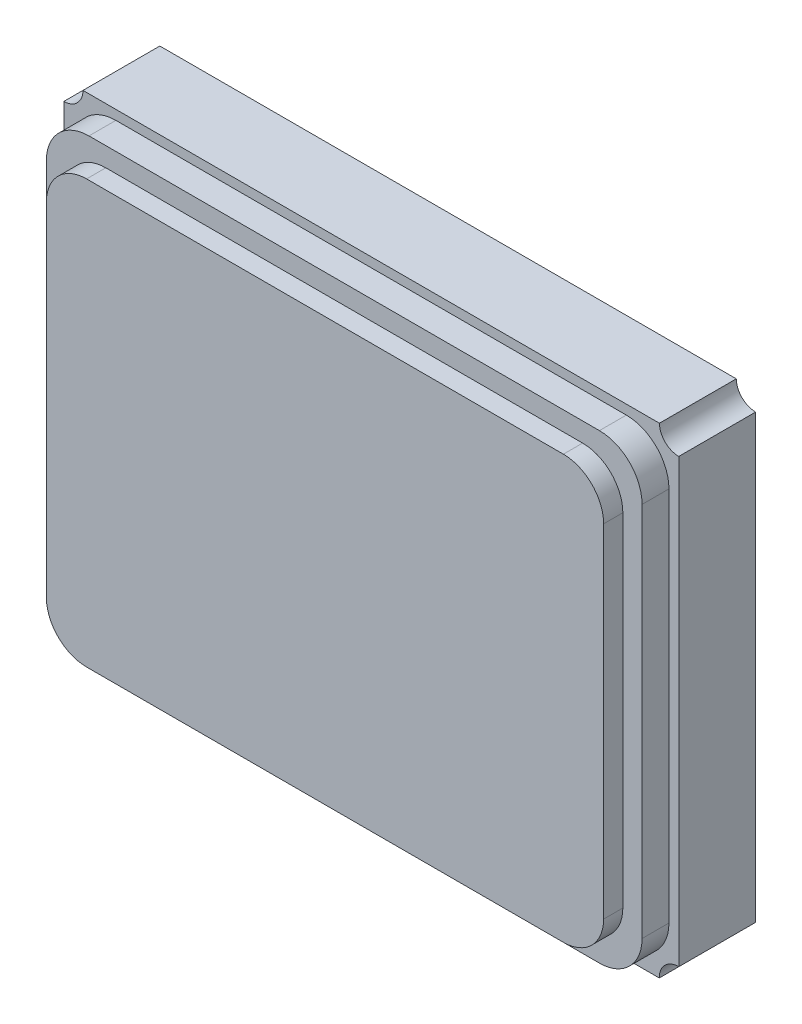
ISO-10303-21;
HEADER;
FILE_DESCRIPTION(('STEP AP214'),'2;1');
FILE_NAME('part.step','',(''),(''),'','','');
FILE_SCHEMA(('AUTOMOTIVE_DESIGN { 1 0 10303 214 1 1 1 1 }'));
ENDSEC;
DATA;
#1=APPLICATION_CONTEXT('core data for automotive mechanical design processes');
#2=APPLICATION_PROTOCOL_DEFINITION('international standard','automotive_design',2000,#1);
#3=PRODUCT_CONTEXT('',#1,'mechanical');
#4=PRODUCT('Part','Part','',(#3));
#5=PRODUCT_RELATED_PRODUCT_CATEGORY('part','',(#4));
#6=PRODUCT_DEFINITION_FORMATION('','',#4);
#7=PRODUCT_DEFINITION_CONTEXT('part definition',#1,'design');
#8=PRODUCT_DEFINITION('design','',#6,#7);
#9=PRODUCT_DEFINITION_SHAPE('','',#8);
#10=(LENGTH_UNIT() NAMED_UNIT(*) SI_UNIT(.MILLI.,.METRE.));
#11=(NAMED_UNIT(*) PLANE_ANGLE_UNIT() SI_UNIT($,.RADIAN.));
#12=(NAMED_UNIT(*) SI_UNIT($,.STERADIAN.) SOLID_ANGLE_UNIT());
#13=UNCERTAINTY_MEASURE_WITH_UNIT(LENGTH_MEASURE(1.E-05),#10,'distance_accuracy_value','');
#14=(GEOMETRIC_REPRESENTATION_CONTEXT(3) GLOBAL_UNCERTAINTY_ASSIGNED_CONTEXT((#13)) GLOBAL_UNIT_ASSIGNED_CONTEXT((#10,
#11,#12)) REPRESENTATION_CONTEXT('',''));
#15=CARTESIAN_POINT('',(0.,0.,0.));
#16=DIRECTION('',(0.,0.,1.));
#17=DIRECTION('',(1.,0.,0.));
#18=AXIS2_PLACEMENT_3D('',#15,#16,#17);
#19=CARTESIAN_POINT('',(0.,0.,0.64));
#20=DIRECTION('',(0.,0.,1.));
#21=DIRECTION('',(0.,-1.,0.));
#22=AXIS2_PLACEMENT_3D('',#19,#20,#21);
#23=PLANE('',#22);
#24=DIRECTION('',(0.,1.,0.));
#25=VECTOR('',#24,1.);
#26=CARTESIAN_POINT('',(-1.45,0.890692780974,0.64));
#27=LINE('',#26,#25);
#28=CARTESIAN_POINT('',(-1.45,0.890692780974,0.64));
#29=VERTEX_POINT('',#28);
#30=CARTESIAN_POINT('',(-1.45,-0.890692780974,0.64));
#31=VERTEX_POINT('',#30);
#32=EDGE_CURVE('E219',#29,#31,#27,.F.);
#33=ORIENTED_EDGE('',*,*,#32,.T.);
#34=CARTESIAN_POINT('',(-1.240692780974,-0.890692780974,0.64));
#35=DIRECTION('',(0.,0.,-1.));
#36=DIRECTION('',(-1.,0.,0.));
#37=AXIS2_PLACEMENT_3D('',#34,#35,#36);
#38=CIRCLE('',#37,0.209307219026);
#39=CARTESIAN_POINT('',(-1.240692780974,-1.1,0.64));
#40=VERTEX_POINT('',#39);
#41=EDGE_CURVE('E223',#40,#31,#38,.T.);
#42=ORIENTED_EDGE('',*,*,#41,.F.);
#43=DIRECTION('',(1.,0.,0.));
#44=VECTOR('',#43,1.);
#45=CARTESIAN_POINT('',(-1.240692780974,-1.1,0.64));
#46=LINE('',#45,#44);
#47=CARTESIAN_POINT('',(1.240692780974,-1.1,0.64));
#48=VERTEX_POINT('',#47);
#49=EDGE_CURVE('E182',#40,#48,#46,.T.);
#50=ORIENTED_EDGE('',*,*,#49,.T.);
#51=CARTESIAN_POINT('',(1.240692780974,-0.890692780974,0.64));
#52=DIRECTION('',(0.,0.,-1.));
#53=DIRECTION('',(-1.,0.,0.));
#54=AXIS2_PLACEMENT_3D('',#51,#52,#53);
#55=CIRCLE('',#54,0.209307219026);
#56=CARTESIAN_POINT('',(1.45,-0.890692780974,0.64));
#57=VERTEX_POINT('',#56);
#58=EDGE_CURVE('E20',#48,#57,#55,.F.);
#59=ORIENTED_EDGE('',*,*,#58,.T.);
#60=DIRECTION('',(0.,1.,0.));
#61=VECTOR('',#60,1.);
#62=CARTESIAN_POINT('',(1.45,-0.890692780974,0.64));
#63=LINE('',#62,#61);
#64=CARTESIAN_POINT('',(1.45,0.890692780974,0.64));
#65=VERTEX_POINT('',#64);
#66=EDGE_CURVE('E180',#57,#65,#63,.T.);
#67=ORIENTED_EDGE('',*,*,#66,.T.);
#68=CARTESIAN_POINT('',(1.240692780974,0.890692780974,0.64));
#69=DIRECTION('',(0.,0.,-1.));
#70=DIRECTION('',(-1.,0.,0.));
#71=AXIS2_PLACEMENT_3D('',#68,#69,#70);
#72=CIRCLE('',#71,0.209307219026);
#73=CARTESIAN_POINT('',(1.240692780974,1.1,0.64));
#74=VERTEX_POINT('',#73);
#75=EDGE_CURVE('E193',#74,#65,#72,.T.);
#76=ORIENTED_EDGE('',*,*,#75,.F.);
#77=DIRECTION('',(1.,0.,0.));
#78=VECTOR('',#77,1.);
#79=CARTESIAN_POINT('',(1.240692780974,1.1,0.64));
#80=LINE('',#79,#78);
#81=CARTESIAN_POINT('',(-1.240692780974,1.1,0.64));
#82=VERTEX_POINT('',#81);
#83=EDGE_CURVE('E211',#74,#82,#80,.F.);
#84=ORIENTED_EDGE('',*,*,#83,.T.);
#85=CARTESIAN_POINT('',(-1.240692780974,0.890692780974,0.64));
#86=DIRECTION('',(0.,0.,-1.));
#87=DIRECTION('',(-1.,0.,0.));
#88=AXIS2_PLACEMENT_3D('',#85,#86,#87);
#89=CIRCLE('',#88,0.209307219026);
#90=EDGE_CURVE('E215',#29,#82,#89,.T.);
#91=ORIENTED_EDGE('',*,*,#90,.F.);
#92=EDGE_LOOP('',(#33,#42,#50,#59,#67,#76,#84,#91));
#93=FACE_BOUND('',#92,.T.);
#94=ADVANCED_FACE('F17',(#93),#23,.T.);
#95=CARTESIAN_POINT('',(-1.240692780974,-1.1,0.54));
#96=DIRECTION('',(0.,1.,0.));
#97=DIRECTION('',(0.,0.,1.));
#98=AXIS2_PLACEMENT_3D('',#95,#96,#97);
#99=PLANE('',#98);
#100=DIRECTION('',(1.,0.,0.));
#101=VECTOR('',#100,1.);
#102=CARTESIAN_POINT('',(0.,-1.1,0.54));
#103=LINE('',#102,#101);
#104=CARTESIAN_POINT('',(1.240692780974,-1.1,0.54));
#105=VERTEX_POINT('',#104);
#106=CARTESIAN_POINT('',(-1.240692780974,-1.1,0.54));
#107=VERTEX_POINT('',#106);
#108=EDGE_CURVE('E200',#105,#107,#103,.F.);
#109=ORIENTED_EDGE('',*,*,#108,.F.);
#110=DIRECTION('',(0.,0.,-1.));
#111=VECTOR('',#110,1.);
#112=CARTESIAN_POINT('',(1.240692780974,-1.1,0.54));
#113=LINE('',#112,#111);
#114=EDGE_CURVE('E198',#48,#105,#113,.T.);
#115=ORIENTED_EDGE('',*,*,#114,.F.);
#116=ORIENTED_EDGE('',*,*,#49,.F.);
#117=DIRECTION('',(0.,0.,-1.));
#118=VECTOR('',#117,1.);
#119=CARTESIAN_POINT('',(-1.240692780974,-1.1,0.54));
#120=LINE('',#119,#118);
#121=EDGE_CURVE('E220',#107,#40,#120,.F.);
#122=ORIENTED_EDGE('',*,*,#121,.F.);
#123=EDGE_LOOP('',(#109,#115,#116,#122));
#124=FACE_BOUND('',#123,.T.);
#125=ADVANCED_FACE('F655',(#124),#99,.F.);
#126=CARTESIAN_POINT('',(-1.240692780974,-0.890692780974,0.54));
#127=DIRECTION('',(0.,0.,-1.));
#128=DIRECTION('',(-1.,0.,0.));
#129=AXIS2_PLACEMENT_3D('',#126,#127,#128);
#130=CYLINDRICAL_SURFACE('',#129,0.209307219026);
#131=ORIENTED_EDGE('',*,*,#41,.T.);
#132=DIRECTION('',(0.,0.,-1.));
#133=VECTOR('',#132,1.);
#134=CARTESIAN_POINT('',(-1.45,-0.890692780974,0.54));
#135=LINE('',#134,#133);
#136=CARTESIAN_POINT('',(-1.45,-0.890692780974,0.54));
#137=VERTEX_POINT('',#136);
#138=EDGE_CURVE('E216',#31,#137,#135,.T.);
#139=ORIENTED_EDGE('',*,*,#138,.T.);
#140=CARTESIAN_POINT('',(-1.240692780974,-0.890692780974,0.54));
#141=DIRECTION('',(0.,0.,-1.));
#142=DIRECTION('',(-1.,0.,0.));
#143=AXIS2_PLACEMENT_3D('',#140,#141,#142);
#144=CIRCLE('',#143,0.209307219026);
#145=EDGE_CURVE('E297',#107,#137,#144,.T.);
#146=ORIENTED_EDGE('',*,*,#145,.F.);
#147=ORIENTED_EDGE('',*,*,#121,.T.);
#148=EDGE_LOOP('',(#131,#139,#146,#147));
#149=FACE_BOUND('',#148,.T.);
#150=ADVANCED_FACE('F302',(#149),#130,.T.);
#151=CARTESIAN_POINT('',(-1.45,0.890692780974,0.54));
#152=DIRECTION('',(1.,0.,0.));
#153=DIRECTION('',(0.,0.,-1.));
#154=AXIS2_PLACEMENT_3D('',#151,#152,#153);
#155=PLANE('',#154);
#156=DIRECTION('',(0.,1.,0.));
#157=VECTOR('',#156,1.);
#158=CARTESIAN_POINT('',(-1.45,0.,0.54));
#159=LINE('',#158,#157);
#160=CARTESIAN_POINT('',(-1.45,0.890692780974,0.54));
#161=VERTEX_POINT('',#160);
#162=EDGE_CURVE('E296',#137,#161,#159,.T.);
#163=ORIENTED_EDGE('',*,*,#162,.F.);
#164=ORIENTED_EDGE('',*,*,#138,.F.);
#165=ORIENTED_EDGE('',*,*,#32,.F.);
#166=DIRECTION('',(0.,0.,-1.));
#167=VECTOR('',#166,1.);
#168=CARTESIAN_POINT('',(-1.45,0.890692780974,0.54));
#169=LINE('',#168,#167);
#170=EDGE_CURVE('E212',#161,#29,#169,.F.);
#171=ORIENTED_EDGE('',*,*,#170,.F.);
#172=EDGE_LOOP('',(#163,#164,#165,#171));
#173=FACE_BOUND('',#172,.T.);
#174=ADVANCED_FACE('F307',(#173),#155,.F.);
#175=CARTESIAN_POINT('',(-1.240692780974,0.890692780974,0.54));
#176=DIRECTION('',(0.,0.,-1.));
#177=DIRECTION('',(-1.,0.,0.));
#178=AXIS2_PLACEMENT_3D('',#175,#176,#177);
#179=CYLINDRICAL_SURFACE('',#178,0.209307219026);
#180=ORIENTED_EDGE('',*,*,#90,.T.);
#181=DIRECTION('',(0.,0.,-1.));
#182=VECTOR('',#181,1.);
#183=CARTESIAN_POINT('',(-1.240692780974,1.1,0.54));
#184=LINE('',#183,#182);
#185=CARTESIAN_POINT('',(-1.240692780974,1.1,0.54));
#186=VERTEX_POINT('',#185);
#187=EDGE_CURVE('E208',#82,#186,#184,.T.);
#188=ORIENTED_EDGE('',*,*,#187,.T.);
#189=CARTESIAN_POINT('',(-1.240692780974,0.890692780974,0.54));
#190=DIRECTION('',(0.,0.,-1.));
#191=DIRECTION('',(-1.,0.,0.));
#192=AXIS2_PLACEMENT_3D('',#189,#190,#191);
#193=CIRCLE('',#192,0.209307219026);
#194=EDGE_CURVE('E294',#161,#186,#193,.T.);
#195=ORIENTED_EDGE('',*,*,#194,.F.);
#196=ORIENTED_EDGE('',*,*,#170,.T.);
#197=EDGE_LOOP('',(#180,#188,#195,#196));
#198=FACE_BOUND('',#197,.T.);
#199=ADVANCED_FACE('F312',(#198),#179,.T.);
#200=CARTESIAN_POINT('',(1.240692780974,1.1,0.54));
#201=DIRECTION('',(0.,-1.,0.));
#202=DIRECTION('',(0.,0.,-1.));
#203=AXIS2_PLACEMENT_3D('',#200,#201,#202);
#204=PLANE('',#203);
#205=DIRECTION('',(1.,0.,0.));
#206=VECTOR('',#205,1.);
#207=CARTESIAN_POINT('',(0.,1.1,0.54));
#208=LINE('',#207,#206);
#209=CARTESIAN_POINT('',(1.240692780974,1.1,0.54));
#210=VERTEX_POINT('',#209);
#211=EDGE_CURVE('E293',#186,#210,#208,.T.);
#212=ORIENTED_EDGE('',*,*,#211,.F.);
#213=ORIENTED_EDGE('',*,*,#187,.F.);
#214=ORIENTED_EDGE('',*,*,#83,.F.);
#215=DIRECTION('',(0.,0.,-1.));
#216=VECTOR('',#215,1.);
#217=CARTESIAN_POINT('',(1.240692780974,1.1,0.54));
#218=LINE('',#217,#216);
#219=EDGE_CURVE('E205',#210,#74,#218,.F.);
#220=ORIENTED_EDGE('',*,*,#219,.F.);
#221=EDGE_LOOP('',(#212,#213,#214,#220));
#222=FACE_BOUND('',#221,.T.);
#223=ADVANCED_FACE('F316',(#222),#204,.F.);
#224=CARTESIAN_POINT('',(1.240692780974,0.890692780974,0.54));
#225=DIRECTION('',(0.,0.,-1.));
#226=DIRECTION('',(-1.,0.,0.));
#227=AXIS2_PLACEMENT_3D('',#224,#225,#226);
#228=CYLINDRICAL_SURFACE('',#227,0.209307219026);
#229=ORIENTED_EDGE('',*,*,#75,.T.);
#230=DIRECTION('',(0.,0.,1.));
#231=VECTOR('',#230,1.);
#232=CARTESIAN_POINT('',(1.45,0.890692780974,0.54));
#233=LINE('',#232,#231);
#234=CARTESIAN_POINT('',(1.45,0.890692780974,0.54));
#235=VERTEX_POINT('',#234);
#236=EDGE_CURVE('E192',#65,#235,#233,.F.);
#237=ORIENTED_EDGE('',*,*,#236,.T.);
#238=CARTESIAN_POINT('',(1.240692780974,0.890692780974,0.54));
#239=DIRECTION('',(0.,0.,-1.));
#240=DIRECTION('',(-1.,0.,0.));
#241=AXIS2_PLACEMENT_3D('',#238,#239,#240);
#242=CIRCLE('',#241,0.209307219026);
#243=EDGE_CURVE('E291',#210,#235,#242,.T.);
#244=ORIENTED_EDGE('',*,*,#243,.F.);
#245=ORIENTED_EDGE('',*,*,#219,.T.);
#246=EDGE_LOOP('',(#229,#237,#244,#245));
#247=FACE_BOUND('',#246,.T.);
#248=ADVANCED_FACE('F613',(#247),#228,.T.);
#249=CARTESIAN_POINT('',(1.45,-0.890692780974,0.54));
#250=DIRECTION('',(-1.,0.,0.));
#251=DIRECTION('',(0.,0.,1.));
#252=AXIS2_PLACEMENT_3D('',#249,#250,#251);
#253=PLANE('',#252);
#254=DIRECTION('',(0.,1.,0.));
#255=VECTOR('',#254,1.);
#256=CARTESIAN_POINT('',(1.45,0.,0.54));
#257=LINE('',#256,#255);
#258=CARTESIAN_POINT('',(1.45,-0.890692780974,0.54));
#259=VERTEX_POINT('',#258);
#260=EDGE_CURVE('E290',#235,#259,#257,.F.);
#261=ORIENTED_EDGE('',*,*,#260,.F.);
#262=ORIENTED_EDGE('',*,*,#236,.F.);
#263=ORIENTED_EDGE('',*,*,#66,.F.);
#264=DIRECTION('',(0.,0.,-1.));
#265=VECTOR('',#264,1.);
#266=CARTESIAN_POINT('',(1.45,-0.890692780974,0.54));
#267=LINE('',#266,#265);
#268=EDGE_CURVE('E189',#259,#57,#267,.F.);
#269=ORIENTED_EDGE('',*,*,#268,.F.);
#270=EDGE_LOOP('',(#261,#262,#263,#269));
#271=FACE_BOUND('',#270,.T.);
#272=ADVANCED_FACE('F188',(#271),#253,.F.);
#273=CARTESIAN_POINT('',(1.240692780974,-0.890692780974,0.54));
#274=DIRECTION('',(0.,0.,-1.));
#275=DIRECTION('',(-1.,0.,0.));
#276=AXIS2_PLACEMENT_3D('',#273,#274,#275);
#277=CYLINDRICAL_SURFACE('',#276,0.209307219026);
#278=ORIENTED_EDGE('',*,*,#58,.F.);
#279=ORIENTED_EDGE('',*,*,#114,.T.);
#280=CARTESIAN_POINT('',(1.240692780974,-0.890692780974,0.54));
#281=DIRECTION('',(0.,0.,-1.));
#282=DIRECTION('',(-1.,0.,0.));
#283=AXIS2_PLACEMENT_3D('',#280,#281,#282);
#284=CIRCLE('',#283,0.209307219026);
#285=EDGE_CURVE('E197',#259,#105,#284,.T.);
#286=ORIENTED_EDGE('',*,*,#285,.F.);
#287=ORIENTED_EDGE('',*,*,#268,.T.);
#288=EDGE_LOOP('',(#278,#279,#286,#287));
#289=FACE_BOUND('',#288,.T.);
#290=ADVANCED_FACE('F195',(#289),#277,.T.);
#291=CARTESIAN_POINT('',(0.,0.,0.54));
#292=DIRECTION('',(0.,0.,1.));
#293=DIRECTION('',(1.,0.,0.));
#294=AXIS2_PLACEMENT_3D('',#291,#292,#293);
#295=PLANE('',#294);
#296=ORIENTED_EDGE('',*,*,#260,.T.);
#297=ORIENTED_EDGE('',*,*,#285,.T.);
#298=ORIENTED_EDGE('',*,*,#108,.T.);
#299=ORIENTED_EDGE('',*,*,#145,.T.);
#300=ORIENTED_EDGE('',*,*,#162,.T.);
#301=ORIENTED_EDGE('',*,*,#194,.T.);
#302=ORIENTED_EDGE('',*,*,#211,.T.);
#303=ORIENTED_EDGE('',*,*,#243,.T.);
#304=EDGE_LOOP('',(#296,#297,#298,#299,#300,#301,#302,#303));
#305=FACE_BOUND('',#304,.T.);
#306=DIRECTION('',(0.,1.,0.));
#307=VECTOR('',#306,1.);
#308=CARTESIAN_POINT('',(-1.55,0.978205850256,0.54));
#309=LINE('',#308,#307);
#310=CARTESIAN_POINT('',(-1.55,0.978205850256,0.54));
#311=VERTEX_POINT('',#310);
#312=CARTESIAN_POINT('',(-1.55,-0.978205850256,0.54));
#313=VERTEX_POINT('',#312);
#314=EDGE_CURVE('E284',#311,#313,#309,.F.);
#315=ORIENTED_EDGE('',*,*,#314,.T.);
#316=CARTESIAN_POINT('',(-1.328205850256,-0.978205850256,0.54));
#317=DIRECTION('',(0.,0.,-1.));
#318=DIRECTION('',(-1.,0.,0.));
#319=AXIS2_PLACEMENT_3D('',#316,#317,#318);
#320=CIRCLE('',#319,0.221794149744);
#321=CARTESIAN_POINT('',(-1.328205850256,-1.2,0.54));
#322=VERTEX_POINT('',#321);
#323=EDGE_CURVE('E282',#322,#313,#320,.T.);
#324=ORIENTED_EDGE('',*,*,#323,.F.);
#325=DIRECTION('',(1.,0.,0.));
#326=VECTOR('',#325,1.);
#327=CARTESIAN_POINT('',(-1.328205850256,-1.2,0.54));
#328=LINE('',#327,#326);
#329=CARTESIAN_POINT('',(1.328205850256,-1.2,0.54));
#330=VERTEX_POINT('',#329);
#331=EDGE_CURVE('E288',#322,#330,#328,.T.);
#332=ORIENTED_EDGE('',*,*,#331,.T.);
#333=CARTESIAN_POINT('',(1.328205850256,-0.978205850256,0.54));
#334=DIRECTION('',(0.,0.,-1.));
#335=DIRECTION('',(-1.,0.,0.));
#336=AXIS2_PLACEMENT_3D('',#333,#334,#335);
#337=CIRCLE('',#336,0.221794149744);
#338=CARTESIAN_POINT('',(1.55,-0.978205850256,0.54));
#339=VERTEX_POINT('',#338);
#340=EDGE_CURVE('E286',#339,#330,#337,.T.);
#341=ORIENTED_EDGE('',*,*,#340,.F.);
#342=DIRECTION('',(0.,1.,0.));
#343=VECTOR('',#342,1.);
#344=CARTESIAN_POINT('',(1.55,-0.978205850256,0.54));
#345=LINE('',#344,#343);
#346=CARTESIAN_POINT('',(1.55,0.978205850256,0.54));
#347=VERTEX_POINT('',#346);
#348=EDGE_CURVE('E344',#339,#347,#345,.T.);
#349=ORIENTED_EDGE('',*,*,#348,.T.);
#350=CARTESIAN_POINT('',(1.328205850256,0.978205850256,0.54));
#351=DIRECTION('',(0.,0.,-1.));
#352=DIRECTION('',(-1.,0.,0.));
#353=AXIS2_PLACEMENT_3D('',#350,#351,#352);
#354=CIRCLE('',#353,0.221794149744);
#355=CARTESIAN_POINT('',(1.328205850256,1.2,0.54));
#356=VERTEX_POINT('',#355);
#357=EDGE_CURVE('E274',#356,#347,#354,.T.);
#358=ORIENTED_EDGE('',*,*,#357,.F.);
#359=DIRECTION('',(1.,0.,0.));
#360=VECTOR('',#359,1.);
#361=CARTESIAN_POINT('',(1.328205850256,1.2,0.54));
#362=LINE('',#361,#360);
#363=CARTESIAN_POINT('',(-1.328205850256,1.2,0.54));
#364=VERTEX_POINT('',#363);
#365=EDGE_CURVE('E280',#356,#364,#362,.F.);
#366=ORIENTED_EDGE('',*,*,#365,.T.);
#367=CARTESIAN_POINT('',(-1.328205850256,0.978205850256,0.54));
#368=DIRECTION('',(0.,0.,-1.));
#369=DIRECTION('',(-1.,0.,0.));
#370=AXIS2_PLACEMENT_3D('',#367,#368,#369);
#371=CIRCLE('',#370,0.221794149744);
#372=EDGE_CURVE('E278',#311,#364,#371,.T.);
#373=ORIENTED_EDGE('',*,*,#372,.F.);
#374=EDGE_LOOP('',(#315,#324,#332,#341,#349,#358,#366,#373));
#375=FACE_BOUND('',#374,.T.);
#376=ADVANCED_FACE('F399',(#305,#375),#295,.T.);
#377=CARTESIAN_POINT('',(1.328205850256,-0.978205850256,0.39));
#378=DIRECTION('',(0.,0.,-1.));
#379=DIRECTION('',(-1.,0.,0.));
#380=AXIS2_PLACEMENT_3D('',#377,#378,#379);
#381=CYLINDRICAL_SURFACE('',#380,0.221794149744);
#382=DIRECTION('',(0.,0.,1.));
#383=VECTOR('',#382,1.);
#384=CARTESIAN_POINT('',(1.328205850256,-1.2,0.39));
#385=LINE('',#384,#383);
#386=CARTESIAN_POINT('',(1.328205850256,-1.2,0.4));
#387=VERTEX_POINT('',#386);
#388=EDGE_CURVE('E332',#330,#387,#385,.F.);
#389=ORIENTED_EDGE('',*,*,#388,.T.);
#390=CARTESIAN_POINT('',(1.328205850256,-0.978205850256,0.4));
#391=DIRECTION('',(0.,0.,-1.));
#392=DIRECTION('',(-1.,0.,0.));
#393=AXIS2_PLACEMENT_3D('',#390,#391,#392);
#394=CIRCLE('',#393,0.221794149744);
#395=CARTESIAN_POINT('',(1.55,-0.978205850256,0.4));
#396=VERTEX_POINT('',#395);
#397=EDGE_CURVE('E271',#396,#387,#394,.T.);
#398=ORIENTED_EDGE('',*,*,#397,.F.);
#399=DIRECTION('',(0.,0.,1.));
#400=VECTOR('',#399,1.);
#401=CARTESIAN_POINT('',(1.55,-0.978205850256,0.39));
#402=LINE('',#401,#400);
#403=EDGE_CURVE('E276',#396,#339,#402,.T.);
#404=ORIENTED_EDGE('',*,*,#403,.T.);
#405=ORIENTED_EDGE('',*,*,#340,.T.);
#406=EDGE_LOOP('',(#389,#398,#404,#405));
#407=FACE_BOUND('',#406,.T.);
#408=ADVANCED_FACE('F396',(#407),#381,.T.);
#409=CARTESIAN_POINT('',(-1.328205850256,-1.2,0.39));
#410=DIRECTION('',(0.,1.,0.));
#411=DIRECTION('',(0.,0.,1.));
#412=AXIS2_PLACEMENT_3D('',#409,#410,#411);
#413=PLANE('',#412);
#414=ORIENTED_EDGE('',*,*,#388,.F.);
#415=ORIENTED_EDGE('',*,*,#331,.F.);
#416=DIRECTION('',(0.,0.,-1.));
#417=VECTOR('',#416,1.);
#418=CARTESIAN_POINT('',(-1.328205850256,-1.2,0.39));
#419=LINE('',#418,#417);
#420=CARTESIAN_POINT('',(-1.328205850256,-1.2,0.4));
#421=VERTEX_POINT('',#420);
#422=EDGE_CURVE('E285',#421,#322,#419,.F.);
#423=ORIENTED_EDGE('',*,*,#422,.F.);
#424=DIRECTION('',(1.,0.,0.));
#425=VECTOR('',#424,1.);
#426=CARTESIAN_POINT('',(0.0008802163144183,-1.2,0.4));
#427=LINE('',#426,#425);
#428=EDGE_CURVE('E270',#387,#421,#427,.F.);
#429=ORIENTED_EDGE('',*,*,#428,.F.);
#430=EDGE_LOOP('',(#414,#415,#423,#429));
#431=FACE_BOUND('',#430,.T.);
#432=ADVANCED_FACE('F398',(#431),#413,.F.);
#433=CARTESIAN_POINT('',(-1.328205850256,-0.978205850256,0.39));
#434=DIRECTION('',(0.,0.,-1.));
#435=DIRECTION('',(-1.,0.,0.));
#436=AXIS2_PLACEMENT_3D('',#433,#434,#435);
#437=CYLINDRICAL_SURFACE('',#436,0.221794149744);
#438=DIRECTION('',(0.,0.,-1.));
#439=VECTOR('',#438,1.);
#440=CARTESIAN_POINT('',(-1.55,-0.978205850256,0.39));
#441=LINE('',#440,#439);
#442=CARTESIAN_POINT('',(-1.55,-0.978205850256,0.4));
#443=VERTEX_POINT('',#442);
#444=EDGE_CURVE('E330',#313,#443,#441,.T.);
#445=ORIENTED_EDGE('',*,*,#444,.T.);
#446=CARTESIAN_POINT('',(-1.328205850256,-0.978205850256,0.4));
#447=DIRECTION('',(0.,0.,-1.));
#448=DIRECTION('',(-1.,0.,0.));
#449=AXIS2_PLACEMENT_3D('',#446,#447,#448);
#450=CIRCLE('',#449,0.221794149744);
#451=EDGE_CURVE('E268',#421,#443,#450,.T.);
#452=ORIENTED_EDGE('',*,*,#451,.F.);
#453=ORIENTED_EDGE('',*,*,#422,.T.);
#454=ORIENTED_EDGE('',*,*,#323,.T.);
#455=EDGE_LOOP('',(#445,#452,#453,#454));
#456=FACE_BOUND('',#455,.T.);
#457=ADVANCED_FACE('F364',(#456),#437,.T.);
#458=CARTESIAN_POINT('',(-1.55,0.978205850256,0.39));
#459=DIRECTION('',(1.,0.,0.));
#460=DIRECTION('',(0.,0.,-1.));
#461=AXIS2_PLACEMENT_3D('',#458,#459,#460);
#462=PLANE('',#461);
#463=ORIENTED_EDGE('',*,*,#444,.F.);
#464=ORIENTED_EDGE('',*,*,#314,.F.);
#465=DIRECTION('',(0.,0.,-1.));
#466=VECTOR('',#465,1.);
#467=CARTESIAN_POINT('',(-1.55,0.978205850256,0.39));
#468=LINE('',#467,#466);
#469=CARTESIAN_POINT('',(-1.55,0.978205850256,0.4));
#470=VERTEX_POINT('',#469);
#471=EDGE_CURVE('E281',#470,#311,#468,.F.);
#472=ORIENTED_EDGE('',*,*,#471,.F.);
#473=DIRECTION('',(0.,1.,0.));
#474=VECTOR('',#473,1.);
#475=CARTESIAN_POINT('',(-1.55,-0.0008850774637298,0.4));
#476=LINE('',#475,#474);
#477=EDGE_CURVE('E267',#443,#470,#476,.T.);
#478=ORIENTED_EDGE('',*,*,#477,.F.);
#479=EDGE_LOOP('',(#463,#464,#472,#478));
#480=FACE_BOUND('',#479,.T.);
#481=ADVANCED_FACE('F367',(#480),#462,.F.);
#482=CARTESIAN_POINT('',(-1.328205850256,0.978205850256,0.39));
#483=DIRECTION('',(0.,0.,-1.));
#484=DIRECTION('',(-1.,0.,0.));
#485=AXIS2_PLACEMENT_3D('',#482,#483,#484);
#486=CYLINDRICAL_SURFACE('',#485,0.221794149744);
#487=DIRECTION('',(0.,0.,-1.));
#488=VECTOR('',#487,1.);
#489=CARTESIAN_POINT('',(-1.328205850256,1.2,0.39));
#490=LINE('',#489,#488);
#491=CARTESIAN_POINT('',(-1.328205850256,1.2,0.4));
#492=VERTEX_POINT('',#491);
#493=EDGE_CURVE('E328',#364,#492,#490,.T.);
#494=ORIENTED_EDGE('',*,*,#493,.T.);
#495=CARTESIAN_POINT('',(-1.328205850256,0.978205850256,0.4));
#496=DIRECTION('',(0.,0.,-1.));
#497=DIRECTION('',(-1.,0.,0.));
#498=AXIS2_PLACEMENT_3D('',#495,#496,#497);
#499=CIRCLE('',#498,0.221794149744);
#500=EDGE_CURVE('E265',#470,#492,#499,.T.);
#501=ORIENTED_EDGE('',*,*,#500,.F.);
#502=ORIENTED_EDGE('',*,*,#471,.T.);
#503=ORIENTED_EDGE('',*,*,#372,.T.);
#504=EDGE_LOOP('',(#494,#501,#502,#503));
#505=FACE_BOUND('',#504,.T.);
#506=ADVANCED_FACE('F459',(#505),#486,.T.);
#507=CARTESIAN_POINT('',(1.328205850256,1.2,0.39));
#508=DIRECTION('',(0.,-1.,0.));
#509=DIRECTION('',(0.,0.,-1.));
#510=AXIS2_PLACEMENT_3D('',#507,#508,#509);
#511=PLANE('',#510);
#512=ORIENTED_EDGE('',*,*,#493,.F.);
#513=ORIENTED_EDGE('',*,*,#365,.F.);
#514=DIRECTION('',(0.,0.,-1.));
#515=VECTOR('',#514,1.);
#516=CARTESIAN_POINT('',(1.328205850256,1.2,0.39));
#517=LINE('',#516,#515);
#518=CARTESIAN_POINT('',(1.328205850256,1.2,0.4));
#519=VERTEX_POINT('',#518);
#520=EDGE_CURVE('E277',#519,#356,#517,.F.);
#521=ORIENTED_EDGE('',*,*,#520,.F.);
#522=DIRECTION('',(1.,0.,0.));
#523=VECTOR('',#522,1.);
#524=CARTESIAN_POINT('',(0.0008802163144183,1.2,0.4));
#525=LINE('',#524,#523);
#526=EDGE_CURVE('E264',#492,#519,#525,.T.);
#527=ORIENTED_EDGE('',*,*,#526,.F.);
#528=EDGE_LOOP('',(#512,#513,#521,#527));
#529=FACE_BOUND('',#528,.T.);
#530=ADVANCED_FACE('F455',(#529),#511,.F.);
#531=CARTESIAN_POINT('',(1.328205850256,0.978205850256,0.39));
#532=DIRECTION('',(0.,0.,-1.));
#533=DIRECTION('',(-1.,0.,0.));
#534=AXIS2_PLACEMENT_3D('',#531,#532,#533);
#535=CYLINDRICAL_SURFACE('',#534,0.221794149744);
#536=DIRECTION('',(0.,0.,1.));
#537=VECTOR('',#536,1.);
#538=CARTESIAN_POINT('',(1.55,0.978205850256,0.39));
#539=LINE('',#538,#537);
#540=CARTESIAN_POINT('',(1.55,0.978205850256,0.4));
#541=VERTEX_POINT('',#540);
#542=EDGE_CURVE('E273',#347,#541,#539,.F.);
#543=ORIENTED_EDGE('',*,*,#542,.T.);
#544=CARTESIAN_POINT('',(1.328205850256,0.978205850256,0.4));
#545=DIRECTION('',(0.,0.,-1.));
#546=DIRECTION('',(-1.,0.,0.));
#547=AXIS2_PLACEMENT_3D('',#544,#545,#546);
#548=CIRCLE('',#547,0.221794149744);
#549=EDGE_CURVE('E262',#519,#541,#548,.T.);
#550=ORIENTED_EDGE('',*,*,#549,.F.);
#551=ORIENTED_EDGE('',*,*,#520,.T.);
#552=ORIENTED_EDGE('',*,*,#357,.T.);
#553=EDGE_LOOP('',(#543,#550,#551,#552));
#554=FACE_BOUND('',#553,.T.);
#555=ADVANCED_FACE('F452',(#554),#535,.T.);
#556=CARTESIAN_POINT('',(1.55,-0.978205850256,0.39));
#557=DIRECTION('',(-1.,0.,0.));
#558=DIRECTION('',(0.,0.,1.));
#559=AXIS2_PLACEMENT_3D('',#556,#557,#558);
#560=PLANE('',#559);
#561=ORIENTED_EDGE('',*,*,#542,.F.);
#562=ORIENTED_EDGE('',*,*,#348,.F.);
#563=ORIENTED_EDGE('',*,*,#403,.F.);
#564=DIRECTION('',(0.,1.,0.));
#565=VECTOR('',#564,1.);
#566=CARTESIAN_POINT('',(1.55,-0.0008850774637298,0.4));
#567=LINE('',#566,#565);
#568=EDGE_CURVE('E261',#541,#396,#567,.F.);
#569=ORIENTED_EDGE('',*,*,#568,.F.);
#570=EDGE_LOOP('',(#561,#562,#563,#569));
#571=FACE_BOUND('',#570,.T.);
#572=ADVANCED_FACE('F449',(#571),#560,.F.);
#573=CARTESIAN_POINT('',(0.0008802163144183,-0.0008850774637298,0.4));
#574=DIRECTION('',(0.,0.,1.));
#575=DIRECTION('',(1.,0.,0.));
#576=AXIS2_PLACEMENT_3D('',#573,#574,#575);
#577=PLANE('',#576);
#578=ORIENTED_EDGE('',*,*,#549,.T.);
#579=ORIENTED_EDGE('',*,*,#568,.T.);
#580=ORIENTED_EDGE('',*,*,#397,.T.);
#581=ORIENTED_EDGE('',*,*,#428,.T.);
#582=ORIENTED_EDGE('',*,*,#451,.T.);
#583=ORIENTED_EDGE('',*,*,#477,.T.);
#584=ORIENTED_EDGE('',*,*,#500,.T.);
#585=ORIENTED_EDGE('',*,*,#526,.T.);
#586=EDGE_LOOP('',(#578,#579,#580,#581,#582,#583,#584,#585));
#587=FACE_BOUND('',#586,.T.);
#588=DIRECTION('',(0.,1.,0.));
#589=VECTOR('',#588,1.);
#590=CARTESIAN_POINT('',(1.601127668277,1.150214196517,0.4));
#591=LINE('',#590,#589);
#592=CARTESIAN_POINT('',(1.601127668277,1.15021419651667,0.4));
#593=VERTEX_POINT('',#592);
#594=CARTESIAN_POINT('',(1.601127668277,-1.14978580348281,0.4));
#595=VERTEX_POINT('',#594);
#596=EDGE_CURVE('E250',#593,#595,#591,.F.);
#597=ORIENTED_EDGE('',*,*,#596,.F.);
#598=CARTESIAN_POINT('',(1.600419603578,1.250214196517,0.4));
#599=DIRECTION('',(0.,0.,-1.));
#600=DIRECTION('',(-1.,0.,0.));
#601=AXIS2_PLACEMENT_3D('',#598,#599,#600);
#602=CIRCLE('',#601,0.100002506747);
#603=CARTESIAN_POINT('',(1.50041960357784,1.249506131818,0.4));
#604=VERTEX_POINT('',#603);
#605=EDGE_CURVE('E242',#593,#604,#602,.T.);
#606=ORIENTED_EDGE('',*,*,#605,.T.);
#607=DIRECTION('',(1.,0.,0.));
#608=VECTOR('',#607,1.);
#609=CARTESIAN_POINT('',(-1.499580396422,1.249506131818,0.4));
#610=LINE('',#609,#608);
#611=CARTESIAN_POINT('',(-1.49958039642222,1.249506131818,0.4));
#612=VERTEX_POINT('',#611);
#613=EDGE_CURVE('E388',#612,#604,#610,.T.);
#614=ORIENTED_EDGE('',*,*,#613,.F.);
#615=CARTESIAN_POINT('',(-1.599580396422,1.249785803483,0.4));
#616=DIRECTION('',(0.,0.,-1.));
#617=DIRECTION('',(-1.,0.,0.));
#618=AXIS2_PLACEMENT_3D('',#615,#616,#617);
#619=CIRCLE('',#618,0.10000039108);
#620=CARTESIAN_POINT('',(-1.599300724757,1.14978580348322,0.4));
#621=VERTEX_POINT('',#620);
#622=EDGE_CURVE('E257',#612,#621,#619,.T.);
#623=ORIENTED_EDGE('',*,*,#622,.T.);
#624=DIRECTION('',(0.,1.,0.));
#625=VECTOR('',#624,1.);
#626=CARTESIAN_POINT('',(-1.599300724757,-1.150214196517,0.4));
#627=LINE('',#626,#625);
#628=CARTESIAN_POINT('',(-1.599300724757,-1.15021419651719,0.4));
#629=VERTEX_POINT('',#628);
#630=EDGE_CURVE('E260',#629,#621,#627,.T.);
#631=ORIENTED_EDGE('',*,*,#630,.F.);
#632=CARTESIAN_POINT('',(-1.600419603578,-1.250214196517,0.4));
#633=DIRECTION('',(0.,0.,-1.));
#634=DIRECTION('',(-1.,0.,0.));
#635=AXIS2_PLACEMENT_3D('',#632,#633,#634);
#636=CIRCLE('',#635,0.100006259253);
#637=CARTESIAN_POINT('',(-1.50041960357809,-1.251333075338,0.4));
#638=VERTEX_POINT('',#637);
#639=EDGE_CURVE('E252',#629,#638,#636,.T.);
#640=ORIENTED_EDGE('',*,*,#639,.T.);
#641=DIRECTION('',(1.,0.,0.));
#642=VECTOR('',#641,1.);
#643=CARTESIAN_POINT('',(1.499580396422,-1.251333075338,0.4));
#644=LINE('',#643,#642);
#645=CARTESIAN_POINT('',(1.49958039642162,-1.251333075338,0.4));
#646=VERTEX_POINT('',#645);
#647=EDGE_CURVE('E255',#646,#638,#644,.F.);
#648=ORIENTED_EDGE('',*,*,#647,.F.);
#649=CARTESIAN_POINT('',(1.599580396422,-1.249785803483,0.4));
#650=DIRECTION('',(0.,0.,-1.));
#651=DIRECTION('',(-1.,0.,0.));
#652=AXIS2_PLACEMENT_3D('',#649,#650,#651);
#653=CIRCLE('',#652,0.100011969535);
#654=EDGE_CURVE('E247',#646,#595,#653,.T.);
#655=ORIENTED_EDGE('',*,*,#654,.T.);
#656=EDGE_LOOP('',(#597,#606,#614,#623,#631,#640,#648,#655));
#657=FACE_BOUND('',#656,.T.);
#658=ADVANCED_FACE('F391',(#587,#657),#577,.T.);
#659=CARTESIAN_POINT('',(-1.599580396422,1.249785803483,0.));
#660=DIRECTION('',(0.,0.,-1.));
#661=DIRECTION('',(-1.,0.,0.));
#662=AXIS2_PLACEMENT_3D('',#659,#660,#661);
#663=CYLINDRICAL_SURFACE('',#662,0.10000039108);
#664=DIRECTION('',(0.,0.,1.));
#665=VECTOR('',#664,1.);
#666=CARTESIAN_POINT('',(-1.599300724757,1.149785803483,0.));
#667=LINE('',#666,#665);
#668=CARTESIAN_POINT('',(-1.599300724757,1.14978580348322,0.));
#669=VERTEX_POINT('',#668);
#670=EDGE_CURVE('E378',#621,#669,#667,.F.);
#671=ORIENTED_EDGE('',*,*,#670,.F.);
#672=ORIENTED_EDGE('',*,*,#622,.F.);
#673=DIRECTION('',(0.,0.,1.));
#674=VECTOR('',#673,1.);
#675=CARTESIAN_POINT('',(-1.499580396422,1.249506131818,0.));
#676=LINE('',#675,#674);
#677=CARTESIAN_POINT('',(-1.49958039642222,1.249506131818,0.));
#678=VERTEX_POINT('',#677);
#679=EDGE_CURVE('E245',#678,#612,#676,.T.);
#680=ORIENTED_EDGE('',*,*,#679,.F.);
#681=CARTESIAN_POINT('',(-1.599580396422,1.249785803483,0.));
#682=DIRECTION('',(0.,0.,-1.));
#683=DIRECTION('',(-1.,0.,0.));
#684=AXIS2_PLACEMENT_3D('',#681,#682,#683);
#685=CIRCLE('',#684,0.10000039108);
#686=EDGE_CURVE('E239',#678,#669,#685,.T.);
#687=ORIENTED_EDGE('',*,*,#686,.T.);
#688=EDGE_LOOP('',(#671,#672,#680,#687));
#689=FACE_BOUND('',#688,.T.);
#690=ADVANCED_FACE('F443',(#689),#663,.F.);
#691=CARTESIAN_POINT('',(-1.599300724757,-1.150214196517,0.));
#692=DIRECTION('',(-1.,0.,0.));
#693=DIRECTION('',(0.,0.,1.));
#694=AXIS2_PLACEMENT_3D('',#691,#692,#693);
#695=PLANE('',#694);
#696=ORIENTED_EDGE('',*,*,#670,.T.);
#697=DIRECTION('',(0.,1.,0.));
#698=VECTOR('',#697,1.);
#699=CARTESIAN_POINT('',(-1.599300724757,-0.0008850774637298,0.));
#700=LINE('',#699,#698);
#701=CARTESIAN_POINT('',(-1.599300724757,-1.15021419651719,0.));
#702=VERTEX_POINT('',#701);
#703=EDGE_CURVE('E238',#669,#702,#700,.F.);
#704=ORIENTED_EDGE('',*,*,#703,.T.);
#705=DIRECTION('',(0.,0.,-1.));
#706=VECTOR('',#705,1.);
#707=CARTESIAN_POINT('',(-1.599300724757,-1.15021419651719,0.));
#708=LINE('',#707,#706);
#709=EDGE_CURVE('E256',#702,#629,#708,.F.);
#710=ORIENTED_EDGE('',*,*,#709,.T.);
#711=ORIENTED_EDGE('',*,*,#630,.T.);
#712=EDGE_LOOP('',(#696,#704,#710,#711));
#713=FACE_BOUND('',#712,.T.);
#714=ADVANCED_FACE('F439',(#713),#695,.T.);
#715=CARTESIAN_POINT('',(-1.600419603578,-1.250214196517,0.));
#716=DIRECTION('',(0.,0.,-1.));
#717=DIRECTION('',(-1.,0.,0.));
#718=AXIS2_PLACEMENT_3D('',#715,#716,#717);
#719=CYLINDRICAL_SURFACE('',#718,0.100006259253);
#720=DIRECTION('',(0.,0.,-1.));
#721=VECTOR('',#720,1.);
#722=CARTESIAN_POINT('',(-1.500419603578,-1.251333075338,0.));
#723=LINE('',#722,#721);
#724=CARTESIAN_POINT('',(-1.50041960357809,-1.251333075338,0.));
#725=VERTEX_POINT('',#724);
#726=EDGE_CURVE('E377',#638,#725,#723,.T.);
#727=ORIENTED_EDGE('',*,*,#726,.F.);
#728=ORIENTED_EDGE('',*,*,#639,.F.);
#729=ORIENTED_EDGE('',*,*,#709,.F.);
#730=CARTESIAN_POINT('',(-1.600419603578,-1.250214196517,0.));
#731=DIRECTION('',(0.,0.,-1.));
#732=DIRECTION('',(-1.,0.,0.));
#733=AXIS2_PLACEMENT_3D('',#730,#731,#732);
#734=CIRCLE('',#733,0.100006259253);
#735=EDGE_CURVE('E235',#702,#725,#734,.T.);
#736=ORIENTED_EDGE('',*,*,#735,.T.);
#737=EDGE_LOOP('',(#727,#728,#729,#736));
#738=FACE_BOUND('',#737,.T.);
#739=ADVANCED_FACE('F435',(#738),#719,.F.);
#740=CARTESIAN_POINT('',(1.499580396422,-1.251333075338,0.));
#741=DIRECTION('',(0.,-1.,0.));
#742=DIRECTION('',(0.,0.,-1.));
#743=AXIS2_PLACEMENT_3D('',#740,#741,#742);
#744=PLANE('',#743);
#745=ORIENTED_EDGE('',*,*,#726,.T.);
#746=DIRECTION('',(1.,0.,0.));
#747=VECTOR('',#746,1.);
#748=CARTESIAN_POINT('',(0.0008802163144183,-1.251333075338,0.));
#749=LINE('',#748,#747);
#750=CARTESIAN_POINT('',(1.49958039642162,-1.251333075338,0.));
#751=VERTEX_POINT('',#750);
#752=EDGE_CURVE('E234',#725,#751,#749,.T.);
#753=ORIENTED_EDGE('',*,*,#752,.T.);
#754=DIRECTION('',(0.,0.,-1.));
#755=VECTOR('',#754,1.);
#756=CARTESIAN_POINT('',(1.49958039642162,-1.25133307533801,0.));
#757=LINE('',#756,#755);
#758=EDGE_CURVE('E251',#751,#646,#757,.F.);
#759=ORIENTED_EDGE('',*,*,#758,.T.);
#760=ORIENTED_EDGE('',*,*,#647,.T.);
#761=EDGE_LOOP('',(#745,#753,#759,#760));
#762=FACE_BOUND('',#761,.T.);
#763=ADVANCED_FACE('F431',(#762),#744,.T.);
#764=CARTESIAN_POINT('',(1.599580396422,-1.249785803483,0.));
#765=DIRECTION('',(0.,0.,-1.));
#766=DIRECTION('',(-1.,0.,0.));
#767=AXIS2_PLACEMENT_3D('',#764,#765,#766);
#768=CYLINDRICAL_SURFACE('',#767,0.100011969535);
#769=DIRECTION('',(0.,0.,-1.));
#770=VECTOR('',#769,1.);
#771=CARTESIAN_POINT('',(1.601127668277,-1.149785803483,0.));
#772=LINE('',#771,#770);
#773=CARTESIAN_POINT('',(1.601127668277,-1.14978580348281,0.));
#774=VERTEX_POINT('',#773);
#775=EDGE_CURVE('E376',#595,#774,#772,.T.);
#776=ORIENTED_EDGE('',*,*,#775,.F.);
#777=ORIENTED_EDGE('',*,*,#654,.F.);
#778=ORIENTED_EDGE('',*,*,#758,.F.);
#779=CARTESIAN_POINT('',(1.599580396422,-1.249785803483,0.));
#780=DIRECTION('',(0.,0.,-1.));
#781=DIRECTION('',(-1.,0.,0.));
#782=AXIS2_PLACEMENT_3D('',#779,#780,#781);
#783=CIRCLE('',#782,0.100011969535);
#784=EDGE_CURVE('E231',#751,#774,#783,.T.);
#785=ORIENTED_EDGE('',*,*,#784,.T.);
#786=EDGE_LOOP('',(#776,#777,#778,#785));
#787=FACE_BOUND('',#786,.T.);
#788=ADVANCED_FACE('F427',(#787),#768,.F.);
#789=CARTESIAN_POINT('',(1.601127668277,1.150214196517,0.));
#790=DIRECTION('',(1.,0.,0.));
#791=DIRECTION('',(0.,0.,-1.));
#792=AXIS2_PLACEMENT_3D('',#789,#790,#791);
#793=PLANE('',#792);
#794=ORIENTED_EDGE('',*,*,#775,.T.);
#795=DIRECTION('',(0.,1.,0.));
#796=VECTOR('',#795,1.);
#797=CARTESIAN_POINT('',(1.601127668277,-0.0008850774637298,0.));
#798=LINE('',#797,#796);
#799=CARTESIAN_POINT('',(1.601127668277,1.15021419651667,0.));
#800=VERTEX_POINT('',#799);
#801=EDGE_CURVE('E230',#774,#800,#798,.T.);
#802=ORIENTED_EDGE('',*,*,#801,.T.);
#803=DIRECTION('',(0.,0.,-1.));
#804=VECTOR('',#803,1.);
#805=CARTESIAN_POINT('',(1.601127668277,1.15021419651667,0.));
#806=LINE('',#805,#804);
#807=EDGE_CURVE('E246',#800,#593,#806,.F.);
#808=ORIENTED_EDGE('',*,*,#807,.T.);
#809=ORIENTED_EDGE('',*,*,#596,.T.);
#810=EDGE_LOOP('',(#794,#802,#808,#809));
#811=FACE_BOUND('',#810,.T.);
#812=ADVANCED_FACE('F423',(#811),#793,.T.);
#813=CARTESIAN_POINT('',(1.600419603578,1.250214196517,0.));
#814=DIRECTION('',(0.,0.,-1.));
#815=DIRECTION('',(-1.,0.,0.));
#816=AXIS2_PLACEMENT_3D('',#813,#814,#815);
#817=CYLINDRICAL_SURFACE('',#816,0.100002506747);
#818=DIRECTION('',(0.,0.,1.));
#819=VECTOR('',#818,1.);
#820=CARTESIAN_POINT('',(1.500419603578,1.249506131818,0.));
#821=LINE('',#820,#819);
#822=CARTESIAN_POINT('',(1.50041960357784,1.249506131818,0.));
#823=VERTEX_POINT('',#822);
#824=EDGE_CURVE('E34',#604,#823,#821,.F.);
#825=ORIENTED_EDGE('',*,*,#824,.F.);
#826=ORIENTED_EDGE('',*,*,#605,.F.);
#827=ORIENTED_EDGE('',*,*,#807,.F.);
#828=CARTESIAN_POINT('',(1.600419603578,1.250214196517,0.));
#829=DIRECTION('',(0.,0.,-1.));
#830=DIRECTION('',(-1.,0.,0.));
#831=AXIS2_PLACEMENT_3D('',#828,#829,#830);
#832=CIRCLE('',#831,0.100002506747);
#833=EDGE_CURVE('E26',#800,#823,#832,.T.);
#834=ORIENTED_EDGE('',*,*,#833,.T.);
#835=EDGE_LOOP('',(#825,#826,#827,#834));
#836=FACE_BOUND('',#835,.T.);
#837=ADVANCED_FACE('F417',(#836),#817,.F.);
#838=CARTESIAN_POINT('',(-1.499580396422,1.249506131818,0.));
#839=DIRECTION('',(0.,1.,0.));
#840=DIRECTION('',(0.,0.,1.));
#841=AXIS2_PLACEMENT_3D('',#838,#839,#840);
#842=PLANE('',#841);
#843=ORIENTED_EDGE('',*,*,#824,.T.);
#844=DIRECTION('',(1.,0.,0.));
#845=VECTOR('',#844,1.);
#846=CARTESIAN_POINT('',(0.0008802163144183,1.249506131818,0.));
#847=LINE('',#846,#845);
#848=EDGE_CURVE('E11',#823,#678,#847,.F.);
#849=ORIENTED_EDGE('',*,*,#848,.T.);
#850=ORIENTED_EDGE('',*,*,#679,.T.);
#851=ORIENTED_EDGE('',*,*,#613,.T.);
#852=EDGE_LOOP('',(#843,#849,#850,#851));
#853=FACE_BOUND('',#852,.T.);
#854=ADVANCED_FACE('F411',(#853),#842,.T.);
#855=CARTESIAN_POINT('',(0.0008802163144183,-0.0008850774637298,0.));
#856=DIRECTION('',(0.,0.,1.));
#857=DIRECTION('',(1.,0.,0.));
#858=AXIS2_PLACEMENT_3D('',#855,#856,#857);
#859=PLANE('',#858);
#860=ORIENTED_EDGE('',*,*,#833,.F.);
#861=ORIENTED_EDGE('',*,*,#801,.F.);
#862=ORIENTED_EDGE('',*,*,#784,.F.);
#863=ORIENTED_EDGE('',*,*,#752,.F.);
#864=ORIENTED_EDGE('',*,*,#735,.F.);
#865=ORIENTED_EDGE('',*,*,#703,.F.);
#866=ORIENTED_EDGE('',*,*,#686,.F.);
#867=ORIENTED_EDGE('',*,*,#848,.F.);
#868=EDGE_LOOP('',(#860,#861,#862,#863,#864,#865,#866,#867));
#869=FACE_BOUND('',#868,.T.);
#870=ADVANCED_FACE('F409',(#869),#859,.F.);
#871=CLOSED_SHELL('',(#94,#125,#150,#174,#199,#223,#248,#272,#290,#376,#408,#432,#457,#481,#506,
#530,#555,#572,#658,#690,#714,#739,#763,#788,#812,#837,#854,#870));
#872=MANIFOLD_SOLID_BREP('B1',#871);
#873=ADVANCED_BREP_SHAPE_REPRESENTATION('',(#18,#872),#14);
#874=SHAPE_DEFINITION_REPRESENTATION(#9,#873);
ENDSEC;
END-ISO-10303-21;
